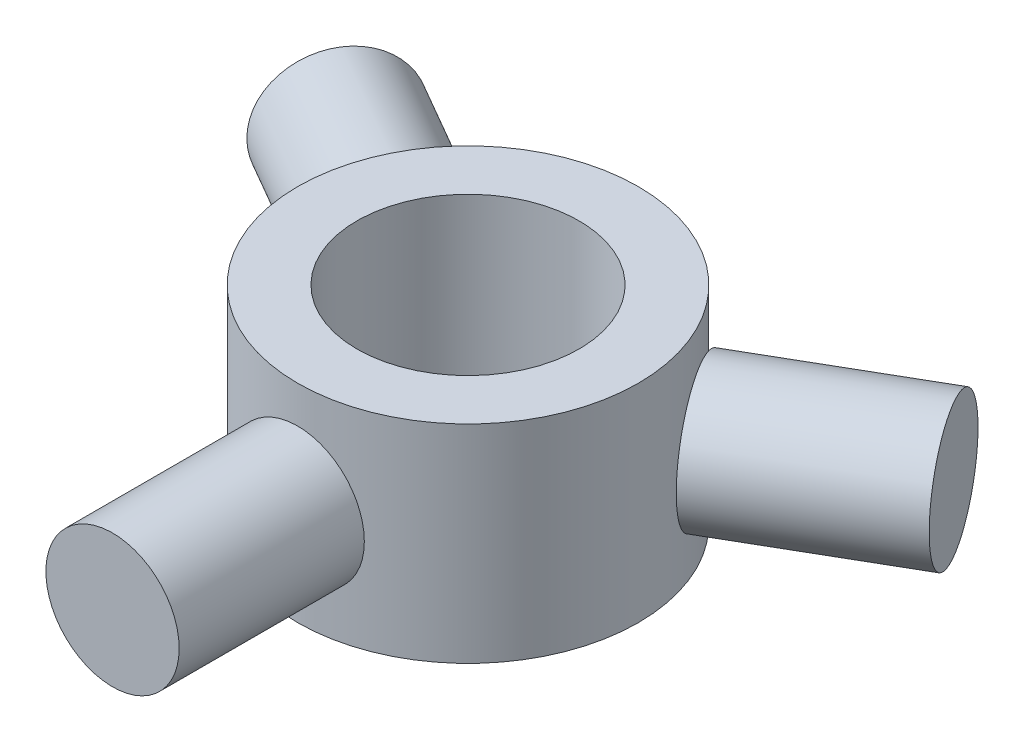
ISO-10303-21;
HEADER;
FILE_DESCRIPTION(('STEP AP214'),'2;1');
FILE_NAME('part.step','',(''),(''),'','','');
FILE_SCHEMA(('AUTOMOTIVE_DESIGN { 1 0 10303 214 1 1 1 1 }'));
ENDSEC;
DATA;
#1=APPLICATION_CONTEXT('core data for automotive mechanical design processes');
#2=APPLICATION_PROTOCOL_DEFINITION('international standard','automotive_design',2000,#1);
#3=PRODUCT_CONTEXT('',#1,'mechanical');
#4=PRODUCT('Part','Part','',(#3));
#5=PRODUCT_RELATED_PRODUCT_CATEGORY('part','',(#4));
#6=PRODUCT_DEFINITION_FORMATION('','',#4);
#7=PRODUCT_DEFINITION_CONTEXT('part definition',#1,'design');
#8=PRODUCT_DEFINITION('design','',#6,#7);
#9=PRODUCT_DEFINITION_SHAPE('','',#8);
#10=(LENGTH_UNIT() NAMED_UNIT(*) SI_UNIT(.MILLI.,.METRE.));
#11=(NAMED_UNIT(*) PLANE_ANGLE_UNIT() SI_UNIT($,.RADIAN.));
#12=(NAMED_UNIT(*) SI_UNIT($,.STERADIAN.) SOLID_ANGLE_UNIT());
#13=UNCERTAINTY_MEASURE_WITH_UNIT(LENGTH_MEASURE(1.E-05),#10,'distance_accuracy_value','');
#14=(GEOMETRIC_REPRESENTATION_CONTEXT(3) GLOBAL_UNCERTAINTY_ASSIGNED_CONTEXT((#13)) GLOBAL_UNIT_ASSIGNED_CONTEXT((#10,
#11,#12)) REPRESENTATION_CONTEXT('',''));
#15=CARTESIAN_POINT('',(0.,0.,0.));
#16=DIRECTION('',(0.,0.,1.));
#17=DIRECTION('',(1.,0.,0.));
#18=AXIS2_PLACEMENT_3D('',#15,#16,#17);
#19=CARTESIAN_POINT('',(-41.5692193816533,0.,-23.9999999999996));
#20=DIRECTION('',(0.866025403784443,0.,0.499999999999992));
#21=DIRECTION('',(0.499999999999992,0.,-0.866025403784443));
#22=AXIS2_PLACEMENT_3D('',#19,#20,#21);
#23=CYLINDRICAL_SURFACE('',#22,9.);
#24=CARTESIAN_POINT('',(-41.5692193816533,0.,-23.9999999999996));
#25=DIRECTION('',(-0.866025403784443,0.,-0.499999999999992));
#26=DIRECTION('',(-0.499999999999992,0.,0.866025403784443));
#27=AXIS2_PLACEMENT_3D('',#24,#25,#26);
#28=CIRCLE('',#27,9.);
#29=CARTESIAN_POINT('',(-46.0692193816532,0.,-16.2057713659396));
#30=VERTEX_POINT('',#29);
#31=EDGE_CURVE('E11',#30,#30,#28,.T.);
#32=ORIENTED_EDGE('',*,*,#31,.F.);
#33=EDGE_LOOP('',(#32));
#34=FACE_BOUND('',#33,.T.);
#35=CARTESIAN_POINT('',(-19.9185842870422,0.,-11.4999999999998));
#36=DIRECTION('',(-0.866025403784443,0.,-0.499999999999992));
#37=DIRECTION('',(-0.499999999999992,0.,0.866025403784443));
#38=AXIS2_PLACEMENT_3D('',#35,#36,#37);
#39=CIRCLE('',#38,9.);
#40=CARTESIAN_POINT('',(-24.4185842870421,0.,-3.70577136593983));
#41=VERTEX_POINT('',#40);
#42=EDGE_CURVE('E45',#41,#41,#39,.T.);
#43=ORIENTED_EDGE('',*,*,#42,.T.);
#44=EDGE_LOOP('',(#43));
#45=FACE_BOUND('',#44,.T.);
#46=ADVANCED_FACE('F42',(#34,#45),#23,.T.);
#47=CARTESIAN_POINT('',(-41.5692193816533,0.,-23.9999999999996));
#48=DIRECTION('',(-0.866025403784443,0.,-0.499999999999992));
#49=DIRECTION('',(-0.499999999999992,0.,0.866025403784443));
#50=AXIS2_PLACEMENT_3D('',#47,#48,#49);
#51=PLANE('',#50);
#52=ORIENTED_EDGE('',*,*,#31,.T.);
#53=EDGE_LOOP('',(#52));
#54=FACE_BOUND('',#53,.T.);
#55=ADVANCED_FACE('F57',(#54),#51,.T.);
#56=CARTESIAN_POINT('',(-19.9185842870422,0.,-11.4999999999998));
#57=DIRECTION('',(-0.866025403784443,0.,-0.499999999999992));
#58=DIRECTION('',(-0.499999999999992,0.,0.866025403784443));
#59=AXIS2_PLACEMENT_3D('',#56,#57,#58);
#60=PLANE('',#59);
#61=ORIENTED_EDGE('',*,*,#42,.F.);
#62=EDGE_LOOP('',(#61));
#63=FACE_BOUND('',#62,.T.);
#64=ADVANCED_FACE('F55',(#63),#60,.F.);
#65=CLOSED_SHELL('',(#46,#55,#64));
#66=MANIFOLD_SOLID_BREP('B2',#65);
#67=CARTESIAN_POINT('',(41.5692193816529,0.,-24.0000000000002));
#68=DIRECTION('',(-0.866025403784436,0.,0.500000000000004));
#69=DIRECTION('',(0.500000000000004,0.,0.866025403784436));
#70=AXIS2_PLACEMENT_3D('',#67,#68,#69);
#71=CYLINDRICAL_SURFACE('',#70,9.);
#72=CARTESIAN_POINT('',(41.5692193816529,0.,-24.0000000000002));
#73=DIRECTION('',(0.866025403784436,0.,-0.500000000000004));
#74=DIRECTION('',(-0.500000000000004,0.,-0.866025403784436));
#75=AXIS2_PLACEMENT_3D('',#72,#73,#74);
#76=CIRCLE('',#75,9.);
#77=CARTESIAN_POINT('',(37.0692193816529,0.,-31.7942286340601));
#78=VERTEX_POINT('',#77);
#79=EDGE_CURVE('E41',#78,#78,#76,.T.);
#80=ORIENTED_EDGE('',*,*,#79,.F.);
#81=EDGE_LOOP('',(#80));
#82=FACE_BOUND('',#81,.T.);
#83=CARTESIAN_POINT('',(19.918584287042,0.,-11.5000000000001));
#84=DIRECTION('',(0.866025403784436,0.,-0.500000000000004));
#85=DIRECTION('',(-0.500000000000004,0.,-0.866025403784436));
#86=AXIS2_PLACEMENT_3D('',#83,#84,#85);
#87=CIRCLE('',#86,9.);
#88=CARTESIAN_POINT('',(15.418584287042,0.,-19.29422863406));
#89=VERTEX_POINT('',#88);
#90=EDGE_CURVE('E94',#89,#89,#87,.T.);
#91=ORIENTED_EDGE('',*,*,#90,.T.);
#92=EDGE_LOOP('',(#91));
#93=FACE_BOUND('',#92,.T.);
#94=ADVANCED_FACE('F91',(#82,#93),#71,.T.);
#95=CARTESIAN_POINT('',(41.5692193816529,0.,-24.0000000000002));
#96=DIRECTION('',(0.866025403784436,0.,-0.500000000000004));
#97=DIRECTION('',(-0.500000000000004,0.,-0.866025403784436));
#98=AXIS2_PLACEMENT_3D('',#95,#96,#97);
#99=PLANE('',#98);
#100=ORIENTED_EDGE('',*,*,#79,.T.);
#101=EDGE_LOOP('',(#100));
#102=FACE_BOUND('',#101,.T.);
#103=ADVANCED_FACE('F106',(#102),#99,.T.);
#104=CARTESIAN_POINT('',(19.918584287042,0.,-11.5000000000001));
#105=DIRECTION('',(0.866025403784436,0.,-0.500000000000004));
#106=DIRECTION('',(-0.500000000000004,0.,-0.866025403784436));
#107=AXIS2_PLACEMENT_3D('',#104,#105,#106);
#108=PLANE('',#107);
#109=ORIENTED_EDGE('',*,*,#90,.F.);
#110=EDGE_LOOP('',(#109));
#111=FACE_BOUND('',#110,.T.);
#112=ADVANCED_FACE('F104',(#111),#108,.F.);
#113=CLOSED_SHELL('',(#94,#103,#112));
#114=MANIFOLD_SOLID_BREP('B6',#113);
#115=CARTESIAN_POINT('',(0.,0.,48.));
#116=DIRECTION('',(0.,0.,-1.));
#117=DIRECTION('',(-1.,0.,0.));
#118=AXIS2_PLACEMENT_3D('',#115,#116,#117);
#119=CYLINDRICAL_SURFACE('',#118,9.);
#120=CARTESIAN_POINT('',(0.,0.,48.));
#121=DIRECTION('',(0.,0.,1.));
#122=DIRECTION('',(1.,0.,0.));
#123=AXIS2_PLACEMENT_3D('',#120,#121,#122);
#124=CIRCLE('',#123,9.);
#125=CARTESIAN_POINT('',(9.,0.,48.));
#126=VERTEX_POINT('',#125);
#127=EDGE_CURVE('E90',#126,#126,#124,.T.);
#128=ORIENTED_EDGE('',*,*,#127,.F.);
#129=EDGE_LOOP('',(#128));
#130=FACE_BOUND('',#129,.T.);
#131=CARTESIAN_POINT('',(0.,0.,23.));
#132=DIRECTION('',(0.,0.,1.));
#133=DIRECTION('',(1.,0.,0.));
#134=AXIS2_PLACEMENT_3D('',#131,#132,#133);
#135=CIRCLE('',#134,9.);
#136=CARTESIAN_POINT('',(9.,0.,23.));
#137=VERTEX_POINT('',#136);
#138=EDGE_CURVE('E142',#137,#137,#135,.T.);
#139=ORIENTED_EDGE('',*,*,#138,.T.);
#140=EDGE_LOOP('',(#139));
#141=FACE_BOUND('',#140,.T.);
#142=ADVANCED_FACE('F139',(#130,#141),#119,.T.);
#143=CARTESIAN_POINT('',(0.,0.,48.));
#144=DIRECTION('',(0.,0.,1.));
#145=DIRECTION('',(1.,0.,0.));
#146=AXIS2_PLACEMENT_3D('',#143,#144,#145);
#147=PLANE('',#146);
#148=ORIENTED_EDGE('',*,*,#127,.T.);
#149=EDGE_LOOP('',(#148));
#150=FACE_BOUND('',#149,.T.);
#151=ADVANCED_FACE('F154',(#150),#147,.T.);
#152=CARTESIAN_POINT('',(0.,0.,23.));
#153=DIRECTION('',(0.,0.,1.));
#154=DIRECTION('',(1.,0.,0.));
#155=AXIS2_PLACEMENT_3D('',#152,#153,#154);
#156=PLANE('',#155);
#157=ORIENTED_EDGE('',*,*,#138,.F.);
#158=EDGE_LOOP('',(#157));
#159=FACE_BOUND('',#158,.T.);
#160=ADVANCED_FACE('F152',(#159),#156,.F.);
#161=CLOSED_SHELL('',(#142,#151,#160));
#162=MANIFOLD_SOLID_BREP('B36',#161);
#163=CARTESIAN_POINT('',(0.,-14.,0.));
#164=DIRECTION('',(0.,1.,0.));
#165=DIRECTION('',(0.,0.,1.));
#166=AXIS2_PLACEMENT_3D('',#163,#164,#165);
#167=CYLINDRICAL_SURFACE('',#166,23.);
#168=CARTESIAN_POINT('',(0.,-14.,0.));
#169=DIRECTION('',(0.,1.,0.));
#170=DIRECTION('',(0.,0.,1.));
#171=AXIS2_PLACEMENT_3D('',#168,#169,#170);
#172=CIRCLE('',#171,23.);
#173=CARTESIAN_POINT('',(0.,-14.,23.));
#174=VERTEX_POINT('',#173);
#175=EDGE_CURVE('E138',#174,#174,#172,.T.);
#176=ORIENTED_EDGE('',*,*,#175,.T.);
#177=EDGE_LOOP('',(#176));
#178=FACE_BOUND('',#177,.T.);
#179=CARTESIAN_POINT('',(0.,14.,0.));
#180=DIRECTION('',(0.,1.,0.));
#181=DIRECTION('',(0.,0.,1.));
#182=AXIS2_PLACEMENT_3D('',#179,#180,#181);
#183=CIRCLE('',#182,23.);
#184=CARTESIAN_POINT('',(0.,14.,23.));
#185=VERTEX_POINT('',#184);
#186=EDGE_CURVE('E190',#185,#185,#183,.T.);
#187=ORIENTED_EDGE('',*,*,#186,.F.);
#188=EDGE_LOOP('',(#187));
#189=FACE_BOUND('',#188,.T.);
#190=ADVANCED_FACE('F180',(#178,#189),#167,.T.);
#191=CARTESIAN_POINT('',(0.,-14.,0.));
#192=DIRECTION('',(0.,1.,0.));
#193=DIRECTION('',(0.,0.,1.));
#194=AXIS2_PLACEMENT_3D('',#191,#192,#193);
#195=PLANE('',#194);
#196=CARTESIAN_POINT('',(0.,-14.,0.));
#197=DIRECTION('',(0.,1.,0.));
#198=DIRECTION('',(0.,0.,1.));
#199=AXIS2_PLACEMENT_3D('',#196,#197,#198);
#200=CIRCLE('',#199,15.);
#201=CARTESIAN_POINT('',(0.,-14.,15.));
#202=VERTEX_POINT('',#201);
#203=EDGE_CURVE('E186',#202,#202,#200,.T.);
#204=ORIENTED_EDGE('',*,*,#203,.T.);
#205=EDGE_LOOP('',(#204));
#206=FACE_BOUND('',#205,.T.);
#207=ORIENTED_EDGE('',*,*,#175,.F.);
#208=EDGE_LOOP('',(#207));
#209=FACE_BOUND('',#208,.T.);
#210=ADVANCED_FACE('F209',(#206,#209),#195,.F.);
#211=CARTESIAN_POINT('',(0.,-14.,0.));
#212=DIRECTION('',(0.,1.,0.));
#213=DIRECTION('',(0.,0.,1.));
#214=AXIS2_PLACEMENT_3D('',#211,#212,#213);
#215=CYLINDRICAL_SURFACE('',#214,15.);
#216=ORIENTED_EDGE('',*,*,#203,.F.);
#217=EDGE_LOOP('',(#216));
#218=FACE_BOUND('',#217,.T.);
#219=CARTESIAN_POINT('',(0.,14.,0.));
#220=DIRECTION('',(0.,1.,0.));
#221=DIRECTION('',(0.,0.,1.));
#222=AXIS2_PLACEMENT_3D('',#219,#220,#221);
#223=CIRCLE('',#222,15.);
#224=CARTESIAN_POINT('',(0.,14.,15.));
#225=VERTEX_POINT('',#224);
#226=EDGE_CURVE('E194',#225,#225,#223,.T.);
#227=ORIENTED_EDGE('',*,*,#226,.T.);
#228=EDGE_LOOP('',(#227));
#229=FACE_BOUND('',#228,.T.);
#230=ADVANCED_FACE('F200',(#218,#229),#215,.F.);
#231=CARTESIAN_POINT('',(0.,14.,0.));
#232=DIRECTION('',(0.,1.,0.));
#233=DIRECTION('',(0.,0.,1.));
#234=AXIS2_PLACEMENT_3D('',#231,#232,#233);
#235=PLANE('',#234);
#236=ORIENTED_EDGE('',*,*,#186,.T.);
#237=EDGE_LOOP('',(#236));
#238=FACE_BOUND('',#237,.T.);
#239=ORIENTED_EDGE('',*,*,#226,.F.);
#240=EDGE_LOOP('',(#239));
#241=FACE_BOUND('',#240,.T.);
#242=ADVANCED_FACE('F202',(#238,#241),#235,.T.);
#243=CLOSED_SHELL('',(#190,#210,#230,#242));
#244=MANIFOLD_SOLID_BREP('B85',#243);
#245=ADVANCED_BREP_SHAPE_REPRESENTATION('',(#18,#66,#114,#162,#244),#14);
#246=SHAPE_DEFINITION_REPRESENTATION(#9,#245);
ENDSEC;
END-ISO-10303-21;
